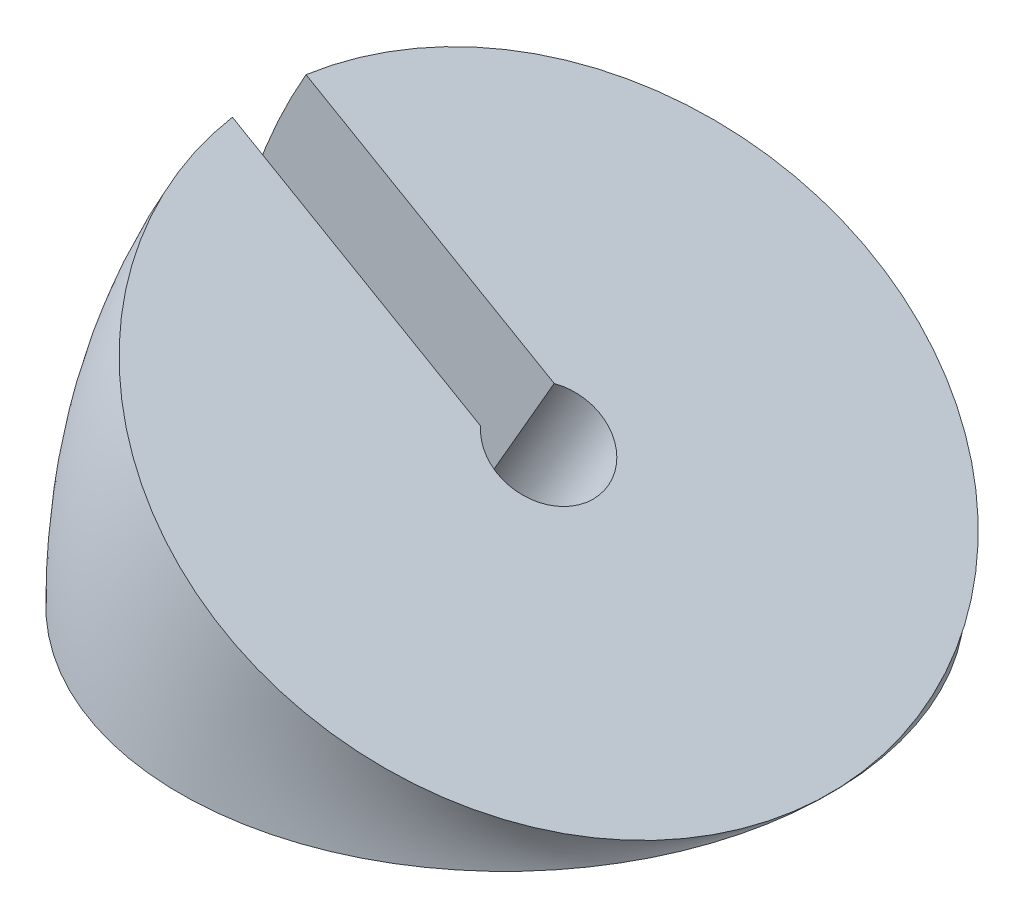
ISO-10303-21;
HEADER;
FILE_DESCRIPTION(('STEP AP214'),'2;1');
FILE_NAME('part.step','',(''),(''),'','','');
FILE_SCHEMA(('AUTOMOTIVE_DESIGN { 1 0 10303 214 1 1 1 1 }'));
ENDSEC;
DATA;
#1=APPLICATION_CONTEXT('core data for automotive mechanical design processes');
#2=APPLICATION_PROTOCOL_DEFINITION('international standard','automotive_design',2000,#1);
#3=PRODUCT_CONTEXT('',#1,'mechanical');
#4=PRODUCT('Part','Part','',(#3));
#5=PRODUCT_RELATED_PRODUCT_CATEGORY('part','',(#4));
#6=PRODUCT_DEFINITION_FORMATION('','',#4);
#7=PRODUCT_DEFINITION_CONTEXT('part definition',#1,'design');
#8=PRODUCT_DEFINITION('design','',#6,#7);
#9=PRODUCT_DEFINITION_SHAPE('','',#8);
#10=(LENGTH_UNIT() NAMED_UNIT(*) SI_UNIT(.MILLI.,.METRE.));
#11=(NAMED_UNIT(*) PLANE_ANGLE_UNIT() SI_UNIT($,.RADIAN.));
#12=(NAMED_UNIT(*) SI_UNIT($,.STERADIAN.) SOLID_ANGLE_UNIT());
#13=UNCERTAINTY_MEASURE_WITH_UNIT(LENGTH_MEASURE(1.E-05),#10,'distance_accuracy_value','');
#14=(GEOMETRIC_REPRESENTATION_CONTEXT(3) GLOBAL_UNCERTAINTY_ASSIGNED_CONTEXT((#13)) GLOBAL_UNIT_ASSIGNED_CONTEXT((#10,
#11,#12)) REPRESENTATION_CONTEXT('',''));
#15=CARTESIAN_POINT('',(0.,0.,0.));
#16=DIRECTION('',(0.,0.,1.));
#17=DIRECTION('',(1.,0.,0.));
#18=AXIS2_PLACEMENT_3D('',#15,#16,#17);
#19=CARTESIAN_POINT('',(22.1,0.,0.));
#20=DIRECTION('',(0.,0.,1.));
#21=DIRECTION('',(1.,0.,0.));
#22=AXIS2_PLACEMENT_3D('',#19,#20,#21);
#23=TOROIDAL_SURFACE('',#22,22.1,22.05);
#24=CARTESIAN_POINT('',(22.1,0.,2.50000000000001));
#25=DIRECTION('',(0.,0.,-1.));
#26=DIRECTION('',(-1.,0.,0.));
#27=AXIS2_PLACEMENT_3D('',#24,#25,#26);
#28=CIRCLE('',#27,44.0078182391584);
#29=CARTESIAN_POINT('',(-21.9078182391584,0.,2.50000000000001));
#30=VERTEX_POINT('',#29);
#31=CARTESIAN_POINT('',(-16.0118885602393,22.0039091195792,2.50000000000001));
#32=VERTEX_POINT('',#31);
#33=EDGE_CURVE('E114',#30,#32,#28,.T.);
#34=ORIENTED_EDGE('',*,*,#33,.F.);
#35=CARTESIAN_POINT('',(0.,0.,0.));
#36=DIRECTION('',(0.,1.,0.));
#37=DIRECTION('',(0.,0.,1.));
#38=AXIS2_PLACEMENT_3D('',#35,#36,#37);
#39=CIRCLE('',#38,22.05);
#40=CARTESIAN_POINT('',(-21.9078182391584,0.,-2.5));
#41=VERTEX_POINT('',#40);
#42=EDGE_CURVE('E117',#30,#41,#39,.T.);
#43=ORIENTED_EDGE('',*,*,#42,.T.);
#44=CARTESIAN_POINT('',(22.1,0.,-2.50000000000002));
#45=DIRECTION('',(0.,0.,-1.));
#46=DIRECTION('',(-1.,0.,0.));
#47=AXIS2_PLACEMENT_3D('',#44,#45,#46);
#48=CIRCLE('',#47,44.0078182391584);
#49=CARTESIAN_POINT('',(-16.0118885602393,22.0039091195792,-2.5));
#50=VERTEX_POINT('',#49);
#51=EDGE_CURVE('E58',#41,#50,#48,.T.);
#52=ORIENTED_EDGE('',*,*,#51,.T.);
#53=CARTESIAN_POINT('',(2.96083857636392,11.05,0.));
#54=DIRECTION('',(0.500000000000001,0.866025403784438,0.));
#55=DIRECTION('',(0.,0.,1.));
#56=AXIS2_PLACEMENT_3D('',#53,#54,#55);
#57=CIRCLE('',#56,22.05);
#58=EDGE_CURVE('E104',#32,#50,#57,.T.);
#59=ORIENTED_EDGE('',*,*,#58,.F.);
#60=EDGE_LOOP('',(#34,#43,#52,#59));
#61=FACE_BOUND('',#60,.T.);
#62=ADVANCED_FACE('F43',(#61),#23,.T.);
#63=CARTESIAN_POINT('',(2.96083857636392,11.05,0.));
#64=DIRECTION('',(0.500000000000001,0.866025403784438,0.));
#65=DIRECTION('',(0.,0.,1.));
#66=AXIS2_PLACEMENT_3D('',#63,#64,#65);
#67=PLANE('',#66);
#68=CARTESIAN_POINT('',(2.9608385763639,11.05,0.));
#69=DIRECTION('',(0.500000000000001,0.866025403784438,0.));
#70=DIRECTION('',(-0.866025403784438,0.500000000000001,0.));
#71=AXIS2_PLACEMENT_3D('',#68,#69,#70);
#72=CIRCLE('',#71,3.5);
#73=CARTESIAN_POINT('',(0.83951823280429,12.2747448713916,2.50000000000001));
#74=VERTEX_POINT('',#73);
#75=CARTESIAN_POINT('',(0.839518232804236,12.2747448713917,-2.50000000000001));
#76=VERTEX_POINT('',#75);
#77=EDGE_CURVE('E94',#74,#76,#72,.T.);
#78=ORIENTED_EDGE('',*,*,#77,.F.);
#79=DIRECTION('',(-0.866025403784438,0.500000000000001,0.));
#80=VECTOR('',#79,1.);
#81=CARTESIAN_POINT('',(5.52500000000003,9.56958071181807,2.50000000000001));
#82=LINE('',#81,#80);
#83=EDGE_CURVE('E91',#74,#32,#82,.T.);
#84=ORIENTED_EDGE('',*,*,#83,.T.);
#85=ORIENTED_EDGE('',*,*,#58,.T.);
#86=DIRECTION('',(-0.866025403784438,0.500000000000001,0.));
#87=VECTOR('',#86,1.);
#88=CARTESIAN_POINT('',(5.52500000000003,9.56958071181807,-2.50000000000001));
#89=LINE('',#88,#87);
#90=EDGE_CURVE('E85',#76,#50,#89,.T.);
#91=ORIENTED_EDGE('',*,*,#90,.F.);
#92=EDGE_LOOP('',(#78,#84,#85,#91));
#93=FACE_BOUND('',#92,.T.);
#94=ADVANCED_FACE('F102',(#93),#67,.T.);
#95=CARTESIAN_POINT('',(0.,0.,0.));
#96=DIRECTION('',(0.,1.,0.));
#97=DIRECTION('',(0.,0.,1.));
#98=AXIS2_PLACEMENT_3D('',#95,#96,#97);
#99=PLANE('',#98);
#100=DIRECTION('',(-1.,0.,0.));
#101=VECTOR('',#100,1.);
#102=CARTESIAN_POINT('',(0.,0.,2.50000000000001));
#103=LINE('',#102,#101);
#104=CARTESIAN_POINT('',(-6.24730902292766,0.,2.50000000000001));
#105=VERTEX_POINT('',#104);
#106=EDGE_CURVE('E11',#105,#30,#103,.T.);
#107=ORIENTED_EDGE('',*,*,#106,.F.);
#108=CARTESIAN_POINT('',(-3.41888189818151,0.,0.));
#109=DIRECTION('',(0.,1.,0.));
#110=DIRECTION('',(1.,0.,0.));
#111=AXIS2_PLACEMENT_3D('',#108,#109,#110);
#112=ELLIPSE('',#111,4.04145188432738,3.5);
#113=CARTESIAN_POINT('',(-6.24730902292773,0.,-2.50000000000001));
#114=VERTEX_POINT('',#113);
#115=EDGE_CURVE('E51',#105,#114,#112,.T.);
#116=ORIENTED_EDGE('',*,*,#115,.T.);
#117=DIRECTION('',(-1.,0.,0.));
#118=VECTOR('',#117,1.);
#119=CARTESIAN_POINT('',(0.,0.,-2.50000000000001));
#120=LINE('',#119,#118);
#121=EDGE_CURVE('E86',#114,#41,#120,.T.);
#122=ORIENTED_EDGE('',*,*,#121,.T.);
#123=ORIENTED_EDGE('',*,*,#42,.F.);
#124=EDGE_LOOP('',(#107,#116,#122,#123));
#125=FACE_BOUND('',#124,.T.);
#126=ADVANCED_FACE('F126',(#125),#99,.F.);
#127=CARTESIAN_POINT('',(-8.07666142363615,-8.06751078854147,0.));
#128=DIRECTION('',(0.500000000000001,0.866025403784438,0.));
#129=DIRECTION('',(-0.866025403784438,0.500000000000001,0.));
#130=AXIS2_PLACEMENT_3D('',#127,#128,#129);
#131=CYLINDRICAL_SURFACE('',#130,3.5);
#132=DIRECTION('',(0.500000000000001,0.866025403784438,0.));
#133=VECTOR('',#132,1.);
#134=CARTESIAN_POINT('',(-10.1979817671958,-6.84276591714989,2.50000000000001));
#135=LINE('',#134,#133);
#136=EDGE_CURVE('E90',#105,#74,#135,.T.);
#137=ORIENTED_EDGE('',*,*,#136,.T.);
#138=ORIENTED_EDGE('',*,*,#77,.T.);
#139=DIRECTION('',(0.500000000000001,0.866025403784438,0.));
#140=VECTOR('',#139,1.);
#141=CARTESIAN_POINT('',(-10.1979817671958,-6.84276591714986,-2.50000000000001));
#142=LINE('',#141,#140);
#143=EDGE_CURVE('E81',#114,#76,#142,.T.);
#144=ORIENTED_EDGE('',*,*,#143,.F.);
#145=ORIENTED_EDGE('',*,*,#115,.F.);
#146=EDGE_LOOP('',(#137,#138,#144,#145));
#147=FACE_BOUND('',#146,.T.);
#148=ADVANCED_FACE('F95',(#147),#131,.F.);
#149=CARTESIAN_POINT('',(-5.51250000000002,-9.54793007672345,2.50000000000001));
#150=DIRECTION('',(0.,0.,-1.));
#151=DIRECTION('',(-1.,0.,0.));
#152=AXIS2_PLACEMENT_3D('',#149,#150,#151);
#153=PLANE('',#152);
#154=ORIENTED_EDGE('',*,*,#33,.T.);
#155=ORIENTED_EDGE('',*,*,#83,.F.);
#156=ORIENTED_EDGE('',*,*,#136,.F.);
#157=ORIENTED_EDGE('',*,*,#106,.T.);
#158=EDGE_LOOP('',(#154,#155,#156,#157));
#159=FACE_BOUND('',#158,.T.);
#160=ADVANCED_FACE('F128',(#159),#153,.T.);
#161=CARTESIAN_POINT('',(-5.51250000000002,-9.54793007672345,-2.50000000000001));
#162=DIRECTION('',(0.,0.,-1.));
#163=DIRECTION('',(-1.,0.,0.));
#164=AXIS2_PLACEMENT_3D('',#161,#162,#163);
#165=PLANE('',#164);
#166=ORIENTED_EDGE('',*,*,#121,.F.);
#167=ORIENTED_EDGE('',*,*,#143,.T.);
#168=ORIENTED_EDGE('',*,*,#90,.T.);
#169=ORIENTED_EDGE('',*,*,#51,.F.);
#170=EDGE_LOOP('',(#166,#167,#168,#169));
#171=FACE_BOUND('',#170,.T.);
#172=ADVANCED_FACE('F83',(#171),#165,.F.);
#173=CLOSED_SHELL('',(#62,#94,#126,#148,#160,#172));
#174=MANIFOLD_SOLID_BREP('B2',#173);
#175=ADVANCED_BREP_SHAPE_REPRESENTATION('',(#18,#174),#14);
#176=SHAPE_DEFINITION_REPRESENTATION(#9,#175);
ENDSEC;
END-ISO-10303-21;
